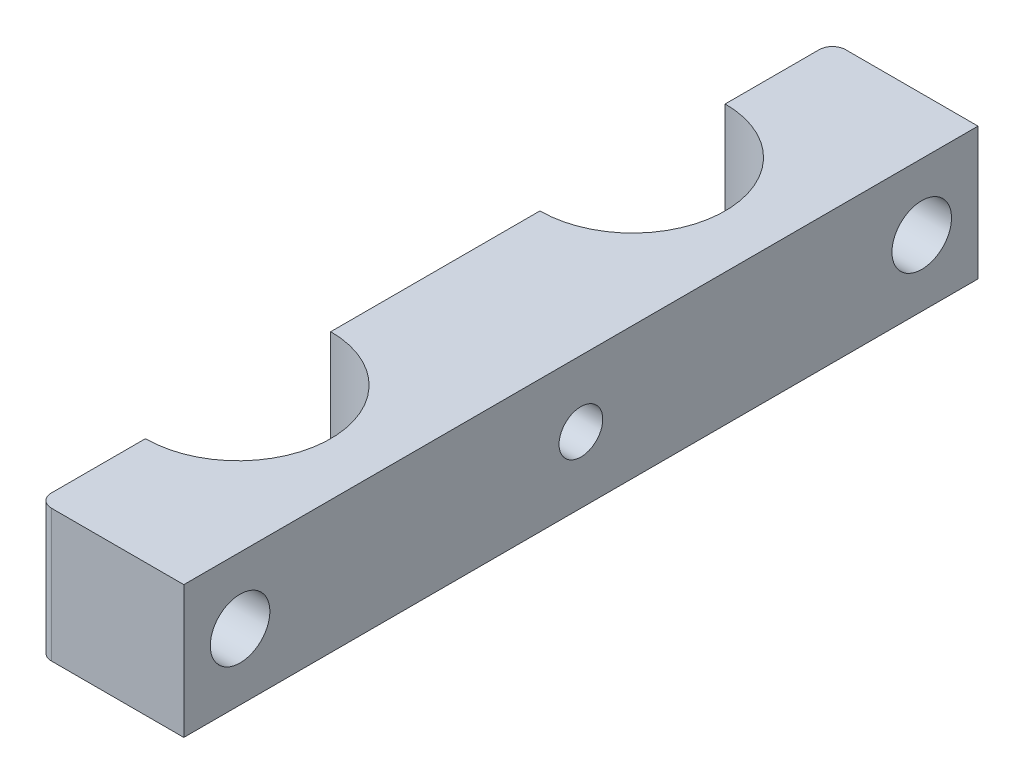
ISO-10303-21;
HEADER;
FILE_DESCRIPTION(('STEP AP214'),'2;1');
FILE_NAME('part.step','',(''),(''),'','','');
FILE_SCHEMA(('AUTOMOTIVE_DESIGN { 1 0 10303 214 1 1 1 1 }'));
ENDSEC;
DATA;
#1=APPLICATION_CONTEXT('core data for automotive mechanical design processes');
#2=APPLICATION_PROTOCOL_DEFINITION('international standard','automotive_design',2000,#1);
#3=PRODUCT_CONTEXT('',#1,'mechanical');
#4=PRODUCT('Part','Part','',(#3));
#5=PRODUCT_RELATED_PRODUCT_CATEGORY('part','',(#4));
#6=PRODUCT_DEFINITION_FORMATION('','',#4);
#7=PRODUCT_DEFINITION_CONTEXT('part definition',#1,'design');
#8=PRODUCT_DEFINITION('design','',#6,#7);
#9=PRODUCT_DEFINITION_SHAPE('','',#8);
#10=(LENGTH_UNIT() NAMED_UNIT(*) SI_UNIT(.MILLI.,.METRE.));
#11=(NAMED_UNIT(*) PLANE_ANGLE_UNIT() SI_UNIT($,.RADIAN.));
#12=(NAMED_UNIT(*) SI_UNIT($,.STERADIAN.) SOLID_ANGLE_UNIT());
#13=UNCERTAINTY_MEASURE_WITH_UNIT(LENGTH_MEASURE(1.E-05),#10,'distance_accuracy_value','');
#14=(GEOMETRIC_REPRESENTATION_CONTEXT(3) GLOBAL_UNCERTAINTY_ASSIGNED_CONTEXT((#13)) GLOBAL_UNIT_ASSIGNED_CONTEXT((#10,
#11,#12)) REPRESENTATION_CONTEXT('',''));
#15=CARTESIAN_POINT('',(0.,0.,0.));
#16=DIRECTION('',(0.,0.,1.));
#17=DIRECTION('',(1.,0.,0.));
#18=AXIS2_PLACEMENT_3D('',#15,#16,#17);
#19=CARTESIAN_POINT('',(3.56584894283637,372.645061039175,-110.773881836316));
#20=DIRECTION('',(0.,0.,-1.));
#21=DIRECTION('',(-1.,0.,0.));
#22=AXIS2_PLACEMENT_3D('',#19,#20,#21);
#23=PLANE('',#22);
#24=DIRECTION('',(-1.,0.,0.));
#25=VECTOR('',#24,1.);
#26=CARTESIAN_POINT('',(3.56584894283637,372.645061039175,-110.773881836316));
#27=LINE('',#26,#25);
#28=CARTESIAN_POINT('',(14.5658489428364,372.645061039175,-110.773881836316));
#29=VERTEX_POINT('',#28);
#30=CARTESIAN_POINT('',(4.56584894283637,372.645061039175,-110.773881836316));
#31=VERTEX_POINT('',#30);
#32=EDGE_CURVE('E119',#29,#31,#27,.T.);
#33=ORIENTED_EDGE('',*,*,#32,.T.);
#34=DIRECTION('',(0.,1.,0.));
#35=VECTOR('',#34,1.);
#36=CARTESIAN_POINT('',(4.56584894283637,372.645061039175,-110.773881836316));
#37=LINE('',#36,#35);
#38=CARTESIAN_POINT('',(4.56584894283637,382.645061039175,-110.773881836316));
#39=VERTEX_POINT('',#38);
#40=EDGE_CURVE('E45',#31,#39,#37,.T.);
#41=ORIENTED_EDGE('',*,*,#40,.T.);
#42=DIRECTION('',(-1.,0.,0.));
#43=VECTOR('',#42,1.);
#44=CARTESIAN_POINT('',(3.56584894283637,382.645061039175,-110.773881836316));
#45=LINE('',#44,#43);
#46=CARTESIAN_POINT('',(14.5658489428364,382.645061039175,-110.773881836316));
#47=VERTEX_POINT('',#46);
#48=EDGE_CURVE('E149',#47,#39,#45,.T.);
#49=ORIENTED_EDGE('',*,*,#48,.F.);
#50=DIRECTION('',(0.,1.,0.));
#51=VECTOR('',#50,1.);
#52=CARTESIAN_POINT('',(14.5658489428364,372.645061039175,-110.773881836316));
#53=LINE('',#52,#51);
#54=EDGE_CURVE('E170',#29,#47,#53,.T.);
#55=ORIENTED_EDGE('',*,*,#54,.F.);
#56=EDGE_LOOP('',(#33,#41,#49,#55));
#57=FACE_BOUND('',#56,.T.);
#58=ADVANCED_FACE('F37',(#57),#23,.T.);
#59=CARTESIAN_POINT('',(14.5658489428364,372.645061039175,-110.773881836316));
#60=DIRECTION('',(1.,0.,0.));
#61=DIRECTION('',(0.,0.,-1.));
#62=AXIS2_PLACEMENT_3D('',#59,#60,#61);
#63=PLANE('',#62);
#64=CARTESIAN_POINT('',(14.5658489428363,377.645061039175,-80.7738818363162));
#65=DIRECTION('',(-1.,0.,0.));
#66=DIRECTION('',(0.,0.,1.));
#67=AXIS2_PLACEMENT_3D('',#64,#65,#66);
#68=CIRCLE('',#67,1.64999999999998);
#69=CARTESIAN_POINT('',(14.5658489428363,377.645061039175,-79.1238818363162));
#70=VERTEX_POINT('',#69);
#71=EDGE_CURVE('E216',#70,#70,#68,.T.);
#72=ORIENTED_EDGE('',*,*,#71,.T.);
#73=EDGE_LOOP('',(#72));
#74=FACE_BOUND('',#73,.T.);
#75=CARTESIAN_POINT('',(14.5658489428363,377.645061039175,-106.523881836316));
#76=DIRECTION('',(-1.,0.,0.));
#77=DIRECTION('',(0.,0.,1.));
#78=AXIS2_PLACEMENT_3D('',#75,#76,#77);
#79=CIRCLE('',#78,2.24999999999997);
#80=CARTESIAN_POINT('',(14.5658489428363,377.645061039175,-104.273881836316));
#81=VERTEX_POINT('',#80);
#82=EDGE_CURVE('E210',#81,#81,#79,.T.);
#83=ORIENTED_EDGE('',*,*,#82,.T.);
#84=EDGE_LOOP('',(#83));
#85=FACE_BOUND('',#84,.T.);
#86=CARTESIAN_POINT('',(14.5658489428363,377.645061039175,-55.0238818363162));
#87=DIRECTION('',(-1.,0.,0.));
#88=DIRECTION('',(0.,0.,1.));
#89=AXIS2_PLACEMENT_3D('',#86,#87,#88);
#90=CIRCLE('',#89,2.24999999999997);
#91=CARTESIAN_POINT('',(14.5658489428363,377.645061039175,-52.7738818363162));
#92=VERTEX_POINT('',#91);
#93=EDGE_CURVE('E153',#92,#92,#90,.T.);
#94=ORIENTED_EDGE('',*,*,#93,.T.);
#95=EDGE_LOOP('',(#94));
#96=FACE_BOUND('',#95,.T.);
#97=DIRECTION('',(0.,0.,-1.));
#98=VECTOR('',#97,1.);
#99=CARTESIAN_POINT('',(14.5658489428364,382.645061039175,-110.773881836316));
#100=LINE('',#99,#98);
#101=CARTESIAN_POINT('',(14.5658489428364,382.645061039175,-50.7738818363162));
#102=VERTEX_POINT('',#101);
#103=EDGE_CURVE('E167',#102,#47,#100,.T.);
#104=ORIENTED_EDGE('',*,*,#103,.F.);
#105=DIRECTION('',(0.,1.,0.));
#106=VECTOR('',#105,1.);
#107=CARTESIAN_POINT('',(14.5658489428364,372.645061039175,-50.7738818363162));
#108=LINE('',#107,#106);
#109=CARTESIAN_POINT('',(14.5658489428364,372.645061039175,-50.7738818363162));
#110=VERTEX_POINT('',#109);
#111=EDGE_CURVE('E173',#110,#102,#108,.T.);
#112=ORIENTED_EDGE('',*,*,#111,.F.);
#113=DIRECTION('',(0.,0.,-1.));
#114=VECTOR('',#113,1.);
#115=CARTESIAN_POINT('',(14.5658489428364,372.645061039175,-110.773881836316));
#116=LINE('',#115,#114);
#117=EDGE_CURVE('E127',#110,#29,#116,.T.);
#118=ORIENTED_EDGE('',*,*,#117,.T.);
#119=ORIENTED_EDGE('',*,*,#54,.T.);
#120=EDGE_LOOP('',(#104,#112,#118,#119));
#121=FACE_BOUND('',#120,.T.);
#122=ADVANCED_FACE('F202',(#74,#85,#96,#121),#63,.T.);
#123=CARTESIAN_POINT('',(3.56584894283638,372.645061039175,-50.7738818363162));
#124=DIRECTION('',(0.,0.,1.));
#125=DIRECTION('',(1.,0.,0.));
#126=AXIS2_PLACEMENT_3D('',#123,#124,#125);
#127=PLANE('',#126);
#128=DIRECTION('',(1.,0.,0.));
#129=VECTOR('',#128,1.);
#130=CARTESIAN_POINT('',(3.56584894283638,382.645061039175,-50.7738818363162));
#131=LINE('',#130,#129);
#132=CARTESIAN_POINT('',(4.56584894283638,382.645061039175,-50.7738818363162));
#133=VERTEX_POINT('',#132);
#134=EDGE_CURVE('E165',#133,#102,#131,.T.);
#135=ORIENTED_EDGE('',*,*,#134,.F.);
#136=DIRECTION('',(0.,1.,0.));
#137=VECTOR('',#136,1.);
#138=CARTESIAN_POINT('',(4.56584894283638,372.645061039175,-50.7738818363162));
#139=LINE('',#138,#137);
#140=CARTESIAN_POINT('',(4.56584894283638,372.645061039175,-50.7738818363162));
#141=VERTEX_POINT('',#140);
#142=EDGE_CURVE('E187',#133,#141,#139,.F.);
#143=ORIENTED_EDGE('',*,*,#142,.T.);
#144=DIRECTION('',(1.,0.,0.));
#145=VECTOR('',#144,1.);
#146=CARTESIAN_POINT('',(3.56584894283638,372.645061039175,-50.7738818363162));
#147=LINE('',#146,#145);
#148=EDGE_CURVE('E145',#141,#110,#147,.T.);
#149=ORIENTED_EDGE('',*,*,#148,.T.);
#150=ORIENTED_EDGE('',*,*,#111,.T.);
#151=EDGE_LOOP('',(#135,#143,#149,#150));
#152=FACE_BOUND('',#151,.T.);
#153=ADVANCED_FACE('F248',(#152),#127,.T.);
#154=CARTESIAN_POINT('',(3.56584894283638,372.645061039175,-58.8738818363162));
#155=DIRECTION('',(-1.,0.,0.));
#156=DIRECTION('',(0.,0.,1.));
#157=AXIS2_PLACEMENT_3D('',#154,#155,#156);
#158=PLANE('',#157);
#159=CARTESIAN_POINT('',(3.56584894283637,377.645061039175,-55.0238818363162));
#160=DIRECTION('',(-1.,0.,0.));
#161=DIRECTION('',(0.,0.,1.));
#162=AXIS2_PLACEMENT_3D('',#159,#160,#161);
#163=CIRCLE('',#162,2.24999999999997);
#164=CARTESIAN_POINT('',(3.56584894283637,377.645061039175,-52.7738818363162));
#165=VERTEX_POINT('',#164);
#166=EDGE_CURVE('E207',#165,#165,#163,.T.);
#167=ORIENTED_EDGE('',*,*,#166,.F.);
#168=EDGE_LOOP('',(#167));
#169=FACE_BOUND('',#168,.T.);
#170=DIRECTION('',(0.,0.,1.));
#171=VECTOR('',#170,1.);
#172=CARTESIAN_POINT('',(3.56584894283638,372.645061039175,-58.8738818363162));
#173=LINE('',#172,#171);
#174=CARTESIAN_POINT('',(3.56584894283638,372.645061039175,-58.8738818363162));
#175=VERTEX_POINT('',#174);
#176=CARTESIAN_POINT('',(3.56584894283638,372.645061039175,-51.7738818363162));
#177=VERTEX_POINT('',#176);
#178=EDGE_CURVE('E142',#175,#177,#173,.T.);
#179=ORIENTED_EDGE('',*,*,#178,.T.);
#180=DIRECTION('',(0.,1.,0.));
#181=VECTOR('',#180,1.);
#182=CARTESIAN_POINT('',(3.56584894283638,372.645061039175,-51.7738818363162));
#183=LINE('',#182,#181);
#184=CARTESIAN_POINT('',(3.56584894283638,382.645061039175,-51.7738818363162));
#185=VERTEX_POINT('',#184);
#186=EDGE_CURVE('E172',#177,#185,#183,.T.);
#187=ORIENTED_EDGE('',*,*,#186,.T.);
#188=DIRECTION('',(0.,0.,1.));
#189=VECTOR('',#188,1.);
#190=CARTESIAN_POINT('',(3.56584894283638,382.645061039175,-58.8738818363162));
#191=LINE('',#190,#189);
#192=CARTESIAN_POINT('',(3.56584894283638,382.645061039175,-58.8738818363162));
#193=VERTEX_POINT('',#192);
#194=EDGE_CURVE('E162',#193,#185,#191,.T.);
#195=ORIENTED_EDGE('',*,*,#194,.F.);
#196=DIRECTION('',(0.,1.,0.));
#197=VECTOR('',#196,1.);
#198=CARTESIAN_POINT('',(3.56584894283638,372.645061039175,-58.8738818363162));
#199=LINE('',#198,#197);
#200=EDGE_CURVE('E176',#175,#193,#199,.T.);
#201=ORIENTED_EDGE('',*,*,#200,.F.);
#202=EDGE_LOOP('',(#179,#187,#195,#201));
#203=FACE_BOUND('',#202,.T.);
#204=ADVANCED_FACE('F259',(#169,#203),#158,.T.);
#205=CARTESIAN_POINT('',(3.56584894283638,372.645061039175,-65.8738818363162));
#206=DIRECTION('',(0.,1.,0.));
#207=DIRECTION('',(0.,0.,1.));
#208=AXIS2_PLACEMENT_3D('',#205,#206,#207);
#209=CYLINDRICAL_SURFACE('',#208,7.);
#210=CARTESIAN_POINT('',(3.56584894283638,382.645061039175,-65.8738818363162));
#211=DIRECTION('',(0.,-1.,0.));
#212=DIRECTION('',(0.,0.,-1.));
#213=AXIS2_PLACEMENT_3D('',#210,#211,#212);
#214=CIRCLE('',#213,7.);
#215=CARTESIAN_POINT('',(3.56584894283637,382.645061039175,-72.8738818363162));
#216=VERTEX_POINT('',#215);
#217=EDGE_CURVE('E159',#216,#193,#214,.T.);
#218=ORIENTED_EDGE('',*,*,#217,.F.);
#219=DIRECTION('',(0.,1.,0.));
#220=VECTOR('',#219,1.);
#221=CARTESIAN_POINT('',(3.56584894283637,372.645061039175,-72.8738818363162));
#222=LINE('',#221,#220);
#223=CARTESIAN_POINT('',(3.56584894283637,372.645061039175,-72.8738818363162));
#224=VERTEX_POINT('',#223);
#225=EDGE_CURVE('E178',#224,#216,#222,.T.);
#226=ORIENTED_EDGE('',*,*,#225,.F.);
#227=CARTESIAN_POINT('',(3.56584894283638,372.645061039175,-65.8738818363162));
#228=DIRECTION('',(0.,-1.,0.));
#229=DIRECTION('',(0.,0.,-1.));
#230=AXIS2_PLACEMENT_3D('',#227,#228,#229);
#231=CIRCLE('',#230,7.);
#232=EDGE_CURVE('E136',#224,#175,#231,.T.);
#233=ORIENTED_EDGE('',*,*,#232,.T.);
#234=ORIENTED_EDGE('',*,*,#200,.T.);
#235=EDGE_LOOP('',(#218,#226,#233,#234));
#236=FACE_BOUND('',#235,.T.);
#237=ADVANCED_FACE('F228',(#236),#209,.F.);
#238=CARTESIAN_POINT('',(3.56584894283638,372.645061039175,-88.6738818363162));
#239=DIRECTION('',(-1.,0.,0.));
#240=DIRECTION('',(0.,0.,1.));
#241=AXIS2_PLACEMENT_3D('',#238,#239,#240);
#242=PLANE('',#241);
#243=CARTESIAN_POINT('',(3.56584894283635,377.645061039175,-80.7738818363162));
#244=DIRECTION('',(-1.,0.,0.));
#245=DIRECTION('',(0.,0.,1.));
#246=AXIS2_PLACEMENT_3D('',#243,#244,#245);
#247=CIRCLE('',#246,1.64999999999998);
#248=CARTESIAN_POINT('',(3.56584894283635,377.645061039175,-79.1238818363162));
#249=VERTEX_POINT('',#248);
#250=EDGE_CURVE('E219',#249,#249,#247,.T.);
#251=ORIENTED_EDGE('',*,*,#250,.F.);
#252=EDGE_LOOP('',(#251));
#253=FACE_BOUND('',#252,.T.);
#254=DIRECTION('',(0.,0.,1.));
#255=VECTOR('',#254,1.);
#256=CARTESIAN_POINT('',(3.56584894283638,382.645061039175,-88.6738818363162));
#257=LINE('',#256,#255);
#258=CARTESIAN_POINT('',(3.56584894283638,382.645061039175,-88.6738818363162));
#259=VERTEX_POINT('',#258);
#260=EDGE_CURVE('E156',#259,#216,#257,.T.);
#261=ORIENTED_EDGE('',*,*,#260,.F.);
#262=DIRECTION('',(0.,1.,0.));
#263=VECTOR('',#262,1.);
#264=CARTESIAN_POINT('',(3.56584894283638,372.645061039175,-88.6738818363162));
#265=LINE('',#264,#263);
#266=CARTESIAN_POINT('',(3.56584894283638,372.645061039175,-88.6738818363162));
#267=VERTEX_POINT('',#266);
#268=EDGE_CURVE('E126',#267,#259,#265,.T.);
#269=ORIENTED_EDGE('',*,*,#268,.F.);
#270=DIRECTION('',(0.,0.,1.));
#271=VECTOR('',#270,1.);
#272=CARTESIAN_POINT('',(3.56584894283638,372.645061039175,-88.6738818363162));
#273=LINE('',#272,#271);
#274=EDGE_CURVE('E134',#267,#224,#273,.T.);
#275=ORIENTED_EDGE('',*,*,#274,.T.);
#276=ORIENTED_EDGE('',*,*,#225,.T.);
#277=EDGE_LOOP('',(#261,#269,#275,#276));
#278=FACE_BOUND('',#277,.T.);
#279=ADVANCED_FACE('F225',(#253,#278),#242,.T.);
#280=CARTESIAN_POINT('',(3.56584894283638,372.645061039175,-95.6738818363162));
#281=DIRECTION('',(0.,1.,0.));
#282=DIRECTION('',(0.,0.,1.));
#283=AXIS2_PLACEMENT_3D('',#280,#281,#282);
#284=CYLINDRICAL_SURFACE('',#283,7.00000000000001);
#285=CARTESIAN_POINT('',(3.56584894283638,382.645061039175,-95.6738818363162));
#286=DIRECTION('',(0.,-1.,0.));
#287=DIRECTION('',(0.,0.,-1.));
#288=AXIS2_PLACEMENT_3D('',#285,#286,#287);
#289=CIRCLE('',#288,7.00000000000001);
#290=CARTESIAN_POINT('',(3.56584894283637,382.645061039175,-102.673881836316));
#291=VERTEX_POINT('',#290);
#292=EDGE_CURVE('E125',#291,#259,#289,.T.);
#293=ORIENTED_EDGE('',*,*,#292,.F.);
#294=DIRECTION('',(0.,1.,0.));
#295=VECTOR('',#294,1.);
#296=CARTESIAN_POINT('',(3.56584894283637,372.645061039175,-102.673881836316));
#297=LINE('',#296,#295);
#298=CARTESIAN_POINT('',(3.56584894283637,372.645061039175,-102.673881836316));
#299=VERTEX_POINT('',#298);
#300=EDGE_CURVE('E115',#299,#291,#297,.T.);
#301=ORIENTED_EDGE('',*,*,#300,.F.);
#302=CARTESIAN_POINT('',(3.56584894283638,372.645061039175,-95.6738818363162));
#303=DIRECTION('',(0.,-1.,0.));
#304=DIRECTION('',(0.,0.,-1.));
#305=AXIS2_PLACEMENT_3D('',#302,#303,#304);
#306=CIRCLE('',#305,7.00000000000001);
#307=EDGE_CURVE('E118',#299,#267,#306,.T.);
#308=ORIENTED_EDGE('',*,*,#307,.T.);
#309=ORIENTED_EDGE('',*,*,#268,.T.);
#310=EDGE_LOOP('',(#293,#301,#308,#309));
#311=FACE_BOUND('',#310,.T.);
#312=ADVANCED_FACE('F123',(#311),#284,.F.);
#313=CARTESIAN_POINT('',(3.56584894283637,372.645061039175,-102.673881836316));
#314=DIRECTION('',(-1.,0.,0.));
#315=DIRECTION('',(0.,0.,1.));
#316=AXIS2_PLACEMENT_3D('',#313,#314,#315);
#317=PLANE('',#316);
#318=CARTESIAN_POINT('',(3.56584894283637,377.645061039175,-106.523881836316));
#319=DIRECTION('',(-1.,0.,0.));
#320=DIRECTION('',(0.,0.,1.));
#321=AXIS2_PLACEMENT_3D('',#318,#319,#320);
#322=CIRCLE('',#321,2.24999999999997);
#323=CARTESIAN_POINT('',(3.56584894283637,377.645061039175,-104.273881836316));
#324=VERTEX_POINT('',#323);
#325=EDGE_CURVE('E213',#324,#324,#322,.T.);
#326=ORIENTED_EDGE('',*,*,#325,.F.);
#327=EDGE_LOOP('',(#326));
#328=FACE_BOUND('',#327,.T.);
#329=DIRECTION('',(0.,0.,1.));
#330=VECTOR('',#329,1.);
#331=CARTESIAN_POINT('',(3.56584894283637,382.645061039175,-102.673881836316));
#332=LINE('',#331,#330);
#333=CARTESIAN_POINT('',(3.56584894283637,382.645061039175,-109.773881836316));
#334=VERTEX_POINT('',#333);
#335=EDGE_CURVE('E152',#334,#291,#332,.T.);
#336=ORIENTED_EDGE('',*,*,#335,.F.);
#337=DIRECTION('',(0.,1.,0.));
#338=VECTOR('',#337,1.);
#339=CARTESIAN_POINT('',(3.56584894283637,372.645061039175,-109.773881836316));
#340=LINE('',#339,#338);
#341=CARTESIAN_POINT('',(3.56584894283637,372.645061039175,-109.773881836316));
#342=VERTEX_POINT('',#341);
#343=EDGE_CURVE('E11',#334,#342,#340,.F.);
#344=ORIENTED_EDGE('',*,*,#343,.T.);
#345=DIRECTION('',(0.,0.,1.));
#346=VECTOR('',#345,1.);
#347=CARTESIAN_POINT('',(3.56584894283637,372.645061039175,-102.673881836316));
#348=LINE('',#347,#346);
#349=EDGE_CURVE('E112',#342,#299,#348,.T.);
#350=ORIENTED_EDGE('',*,*,#349,.T.);
#351=ORIENTED_EDGE('',*,*,#300,.T.);
#352=EDGE_LOOP('',(#336,#344,#350,#351));
#353=FACE_BOUND('',#352,.T.);
#354=ADVANCED_FACE('F114',(#328,#353),#317,.T.);
#355=CARTESIAN_POINT('',(3.56584894283638,372.645061039175,-65.8738818363162));
#356=DIRECTION('',(0.,-1.,0.));
#357=DIRECTION('',(0.,0.,-1.));
#358=AXIS2_PLACEMENT_3D('',#355,#356,#357);
#359=PLANE('',#358);
#360=ORIENTED_EDGE('',*,*,#148,.F.);
#361=CARTESIAN_POINT('',(4.56584894283638,372.645061039175,-51.7738818363162));
#362=DIRECTION('',(0.,-1.,0.));
#363=DIRECTION('',(0.,0.,-1.));
#364=AXIS2_PLACEMENT_3D('',#361,#362,#363);
#365=CIRCLE('',#364,1.);
#366=EDGE_CURVE('E190',#141,#177,#365,.T.);
#367=ORIENTED_EDGE('',*,*,#366,.T.);
#368=ORIENTED_EDGE('',*,*,#178,.F.);
#369=ORIENTED_EDGE('',*,*,#232,.F.);
#370=ORIENTED_EDGE('',*,*,#274,.F.);
#371=ORIENTED_EDGE('',*,*,#307,.F.);
#372=ORIENTED_EDGE('',*,*,#349,.F.);
#373=CARTESIAN_POINT('',(4.56584894283637,372.645061039175,-109.773881836316));
#374=DIRECTION('',(0.,-1.,0.));
#375=DIRECTION('',(0.,0.,-1.));
#376=AXIS2_PLACEMENT_3D('',#373,#374,#375);
#377=CIRCLE('',#376,1.);
#378=EDGE_CURVE('E57',#342,#31,#377,.T.);
#379=ORIENTED_EDGE('',*,*,#378,.T.);
#380=ORIENTED_EDGE('',*,*,#32,.F.);
#381=ORIENTED_EDGE('',*,*,#117,.F.);
#382=EDGE_LOOP('',(#360,#367,#368,#369,#370,#371,#372,#379,#380,#381));
#383=FACE_BOUND('',#382,.T.);
#384=ADVANCED_FACE('F131',(#383),#359,.T.);
#385=CARTESIAN_POINT('',(3.56584894283638,382.645061039175,-65.8738818363162));
#386=DIRECTION('',(0.,-1.,0.));
#387=DIRECTION('',(0.,0.,-1.));
#388=AXIS2_PLACEMENT_3D('',#385,#386,#387);
#389=PLANE('',#388);
#390=ORIENTED_EDGE('',*,*,#194,.T.);
#391=CARTESIAN_POINT('',(4.56584894283638,382.645061039175,-51.7738818363162));
#392=DIRECTION('',(0.,-1.,0.));
#393=DIRECTION('',(0.,0.,-1.));
#394=AXIS2_PLACEMENT_3D('',#391,#392,#393);
#395=CIRCLE('',#394,1.);
#396=EDGE_CURVE('E185',#185,#133,#395,.F.);
#397=ORIENTED_EDGE('',*,*,#396,.T.);
#398=ORIENTED_EDGE('',*,*,#134,.T.);
#399=ORIENTED_EDGE('',*,*,#103,.T.);
#400=ORIENTED_EDGE('',*,*,#48,.T.);
#401=CARTESIAN_POINT('',(4.56584894283637,382.645061039175,-109.773881836316));
#402=DIRECTION('',(0.,-1.,0.));
#403=DIRECTION('',(0.,0.,-1.));
#404=AXIS2_PLACEMENT_3D('',#401,#402,#403);
#405=CIRCLE('',#404,1.);
#406=EDGE_CURVE('E183',#39,#334,#405,.F.);
#407=ORIENTED_EDGE('',*,*,#406,.T.);
#408=ORIENTED_EDGE('',*,*,#335,.T.);
#409=ORIENTED_EDGE('',*,*,#292,.T.);
#410=ORIENTED_EDGE('',*,*,#260,.T.);
#411=ORIENTED_EDGE('',*,*,#217,.T.);
#412=EDGE_LOOP('',(#390,#397,#398,#399,#400,#407,#408,#409,#410,#411));
#413=FACE_BOUND('',#412,.T.);
#414=ADVANCED_FACE('F197',(#413),#389,.F.);
#415=CARTESIAN_POINT('',(4.56584894283638,372.645061039175,-51.7738818363162));
#416=DIRECTION('',(0.,1.,0.));
#417=DIRECTION('',(0.,0.,1.));
#418=AXIS2_PLACEMENT_3D('',#415,#416,#417);
#419=CYLINDRICAL_SURFACE('',#418,1.);
#420=ORIENTED_EDGE('',*,*,#366,.F.);
#421=ORIENTED_EDGE('',*,*,#142,.F.);
#422=ORIENTED_EDGE('',*,*,#396,.F.);
#423=ORIENTED_EDGE('',*,*,#186,.F.);
#424=EDGE_LOOP('',(#420,#421,#422,#423));
#425=FACE_BOUND('',#424,.T.);
#426=ADVANCED_FACE('F234',(#425),#419,.T.);
#427=CARTESIAN_POINT('',(4.56584894283637,372.645061039175,-109.773881836316));
#428=DIRECTION('',(0.,1.,0.));
#429=DIRECTION('',(0.,0.,1.));
#430=AXIS2_PLACEMENT_3D('',#427,#428,#429);
#431=CYLINDRICAL_SURFACE('',#430,1.);
#432=ORIENTED_EDGE('',*,*,#378,.F.);
#433=ORIENTED_EDGE('',*,*,#343,.F.);
#434=ORIENTED_EDGE('',*,*,#406,.F.);
#435=ORIENTED_EDGE('',*,*,#40,.F.);
#436=EDGE_LOOP('',(#432,#433,#434,#435));
#437=FACE_BOUND('',#436,.T.);
#438=ADVANCED_FACE('F39',(#437),#431,.T.);
#439=CARTESIAN_POINT('',(3.56584894283638,377.645061039175,-55.0238818363162));
#440=DIRECTION('',(-1.,0.,0.));
#441=DIRECTION('',(0.,0.,1.));
#442=AXIS2_PLACEMENT_3D('',#439,#440,#441);
#443=CYLINDRICAL_SURFACE('',#442,2.24999999999997);
#444=ORIENTED_EDGE('',*,*,#93,.F.);
#445=EDGE_LOOP('',(#444));
#446=FACE_BOUND('',#445,.T.);
#447=ORIENTED_EDGE('',*,*,#166,.T.);
#448=EDGE_LOOP('',(#447));
#449=FACE_BOUND('',#448,.T.);
#450=ADVANCED_FACE('F233',(#446,#449),#443,.F.);
#451=CARTESIAN_POINT('',(3.56584894283637,377.645061039175,-106.523881836316));
#452=DIRECTION('',(-1.,0.,0.));
#453=DIRECTION('',(0.,0.,1.));
#454=AXIS2_PLACEMENT_3D('',#451,#452,#453);
#455=CYLINDRICAL_SURFACE('',#454,2.24999999999997);
#456=ORIENTED_EDGE('',*,*,#82,.F.);
#457=EDGE_LOOP('',(#456));
#458=FACE_BOUND('',#457,.T.);
#459=ORIENTED_EDGE('',*,*,#325,.T.);
#460=EDGE_LOOP('',(#459));
#461=FACE_BOUND('',#460,.T.);
#462=ADVANCED_FACE('F239',(#458,#461),#455,.F.);
#463=CARTESIAN_POINT('',(3.56584894283635,377.645061039175,-80.7738818363162));
#464=DIRECTION('',(-1.,0.,0.));
#465=DIRECTION('',(0.,0.,1.));
#466=AXIS2_PLACEMENT_3D('',#463,#464,#465);
#467=CYLINDRICAL_SURFACE('',#466,1.64999999999998);
#468=ORIENTED_EDGE('',*,*,#71,.F.);
#469=EDGE_LOOP('',(#468));
#470=FACE_BOUND('',#469,.T.);
#471=ORIENTED_EDGE('',*,*,#250,.T.);
#472=EDGE_LOOP('',(#471));
#473=FACE_BOUND('',#472,.T.);
#474=ADVANCED_FACE('F223',(#470,#473),#467,.F.);
#475=CLOSED_SHELL('',(#58,#122,#153,#204,#237,#279,#312,#354,#384,#414,#426,#438,#450,#462,#474));
#476=MANIFOLD_SOLID_BREP('B2',#475);
#477=ADVANCED_BREP_SHAPE_REPRESENTATION('',(#18,#476),#14);
#478=SHAPE_DEFINITION_REPRESENTATION(#9,#477);
ENDSEC;
END-ISO-10303-21;
